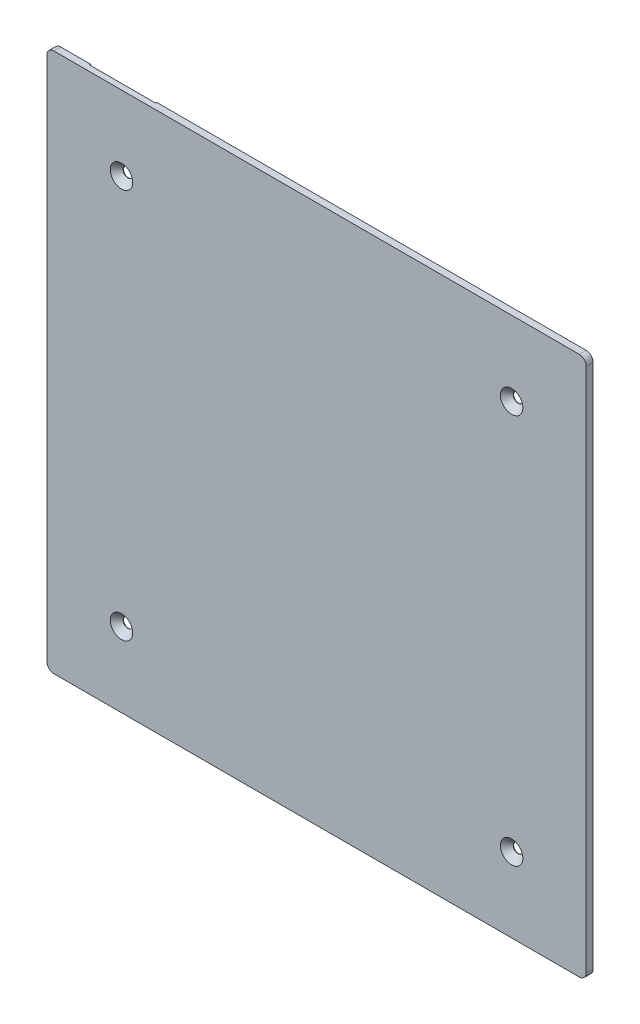
ISO-10303-21;
HEADER;
FILE_DESCRIPTION(('STEP AP214'),'2;1');
FILE_NAME('part.step','',(''),(''),'','','');
FILE_SCHEMA(('AUTOMOTIVE_DESIGN { 1 0 10303 214 1 1 1 1 }'));
ENDSEC;
DATA;
#1=APPLICATION_CONTEXT('core data for automotive mechanical design processes');
#2=APPLICATION_PROTOCOL_DEFINITION('international standard','automotive_design',2000,#1);
#3=PRODUCT_CONTEXT('',#1,'mechanical');
#4=PRODUCT('Part','Part','',(#3));
#5=PRODUCT_RELATED_PRODUCT_CATEGORY('part','',(#4));
#6=PRODUCT_DEFINITION_FORMATION('','',#4);
#7=PRODUCT_DEFINITION_CONTEXT('part definition',#1,'design');
#8=PRODUCT_DEFINITION('design','',#6,#7);
#9=PRODUCT_DEFINITION_SHAPE('','',#8);
#10=(LENGTH_UNIT() NAMED_UNIT(*) SI_UNIT(.MILLI.,.METRE.));
#11=(NAMED_UNIT(*) PLANE_ANGLE_UNIT() SI_UNIT($,.RADIAN.));
#12=(NAMED_UNIT(*) SI_UNIT($,.STERADIAN.) SOLID_ANGLE_UNIT());
#13=UNCERTAINTY_MEASURE_WITH_UNIT(LENGTH_MEASURE(1.E-05),#10,'distance_accuracy_value','');
#14=(GEOMETRIC_REPRESENTATION_CONTEXT(3) GLOBAL_UNCERTAINTY_ASSIGNED_CONTEXT((#13)) GLOBAL_UNIT_ASSIGNED_CONTEXT((#10,
#11,#12)) REPRESENTATION_CONTEXT('',''));
#15=CARTESIAN_POINT('',(0.,0.,0.));
#16=DIRECTION('',(0.,0.,1.));
#17=DIRECTION('',(1.,0.,0.));
#18=AXIS2_PLACEMENT_3D('',#15,#16,#17);
#19=CARTESIAN_POINT('',(-72.6507614869108,117.5,0.5));
#20=DIRECTION('',(1.,0.,0.));
#21=DIRECTION('',(0.,0.,-1.));
#22=AXIS2_PLACEMENT_3D('',#19,#20,#21);
#23=PLANE('',#22);
#24=DIRECTION('',(0.,0.,-1.));
#25=VECTOR('',#24,1.);
#26=CARTESIAN_POINT('',(-72.6507614869108,106.050790199477,0.5));
#27=LINE('',#26,#25);
#28=CARTESIAN_POINT('',(-72.6507614869108,106.050790199477,0.));
#29=VERTEX_POINT('',#28);
#30=CARTESIAN_POINT('',(-72.6507614869108,106.050790199477,0.5));
#31=VERTEX_POINT('',#30);
#32=EDGE_CURVE('E169',#29,#31,#27,.F.);
#33=ORIENTED_EDGE('',*,*,#32,.T.);
#34=DIRECTION('',(0.,1.,0.));
#35=VECTOR('',#34,1.);
#36=CARTESIAN_POINT('',(-72.6507614869108,0.,0.5));
#37=LINE('',#36,#35);
#38=CARTESIAN_POINT('',(-72.6507614869108,117.5,0.5));
#39=VERTEX_POINT('',#38);
#40=EDGE_CURVE('E116',#39,#31,#37,.F.);
#41=ORIENTED_EDGE('',*,*,#40,.F.);
#42=DIRECTION('',(0.,0.,-1.));
#43=VECTOR('',#42,1.);
#44=CARTESIAN_POINT('',(-72.6507614869108,117.5,0.5));
#45=LINE('',#44,#43);
#46=CARTESIAN_POINT('',(-72.6507614869108,117.5,0.));
#47=VERTEX_POINT('',#46);
#48=EDGE_CURVE('E112',#47,#39,#45,.F.);
#49=ORIENTED_EDGE('',*,*,#48,.F.);
#50=DIRECTION('',(0.,1.,0.));
#51=VECTOR('',#50,1.);
#52=CARTESIAN_POINT('',(-72.6507614869108,0.,0.));
#53=LINE('',#52,#51);
#54=EDGE_CURVE('E115',#29,#47,#53,.T.);
#55=ORIENTED_EDGE('',*,*,#54,.F.);
#56=EDGE_LOOP('',(#33,#41,#49,#55));
#57=FACE_BOUND('',#56,.T.);
#58=ADVANCED_FACE('F16',(#57),#23,.F.);
#59=CARTESIAN_POINT('',(-101.46292574176,117.5,0.5));
#60=DIRECTION('',(-1.,0.,0.));
#61=DIRECTION('',(0.,0.,1.));
#62=AXIS2_PLACEMENT_3D('',#59,#60,#61);
#63=PLANE('',#62);
#64=DIRECTION('',(0.,0.,1.));
#65=VECTOR('',#64,1.);
#66=CARTESIAN_POINT('',(-101.46292574176,117.5,0.5));
#67=LINE('',#66,#65);
#68=CARTESIAN_POINT('',(-101.46292574176,117.5,0.5));
#69=VERTEX_POINT('',#68);
#70=CARTESIAN_POINT('',(-101.46292574176,117.5,0.));
#71=VERTEX_POINT('',#70);
#72=EDGE_CURVE('E121',#69,#71,#67,.F.);
#73=ORIENTED_EDGE('',*,*,#72,.F.);
#74=DIRECTION('',(0.,1.,0.));
#75=VECTOR('',#74,1.);
#76=CARTESIAN_POINT('',(-101.46292574176,0.,0.5));
#77=LINE('',#76,#75);
#78=CARTESIAN_POINT('',(-101.46292574176,106.050790199477,0.5));
#79=VERTEX_POINT('',#78);
#80=EDGE_CURVE('E129',#79,#69,#77,.T.);
#81=ORIENTED_EDGE('',*,*,#80,.F.);
#82=DIRECTION('',(0.,0.,-1.));
#83=VECTOR('',#82,1.);
#84=CARTESIAN_POINT('',(-101.46292574176,106.050790199477,0.5));
#85=LINE('',#84,#83);
#86=CARTESIAN_POINT('',(-101.46292574176,106.050790199477,0.));
#87=VERTEX_POINT('',#86);
#88=EDGE_CURVE('E172',#79,#87,#85,.T.);
#89=ORIENTED_EDGE('',*,*,#88,.T.);
#90=DIRECTION('',(0.,1.,0.));
#91=VECTOR('',#90,1.);
#92=CARTESIAN_POINT('',(-101.46292574176,0.,0.));
#93=LINE('',#92,#91);
#94=EDGE_CURVE('E93',#71,#87,#93,.F.);
#95=ORIENTED_EDGE('',*,*,#94,.F.);
#96=EDGE_LOOP('',(#73,#81,#89,#95));
#97=FACE_BOUND('',#96,.T.);
#98=ADVANCED_FACE('F336',(#97),#63,.F.);
#99=CARTESIAN_POINT('',(-72.6507614869108,106.050790199477,0.5));
#100=DIRECTION('',(0.,-1.,0.));
#101=DIRECTION('',(0.,0.,-1.));
#102=AXIS2_PLACEMENT_3D('',#99,#100,#101);
#103=PLANE('',#102);
#104=ORIENTED_EDGE('',*,*,#88,.F.);
#105=DIRECTION('',(-1.,0.,0.));
#106=VECTOR('',#105,1.);
#107=CARTESIAN_POINT('',(0.,106.050790199477,0.5));
#108=LINE('',#107,#106);
#109=EDGE_CURVE('E184',#31,#79,#108,.T.);
#110=ORIENTED_EDGE('',*,*,#109,.F.);
#111=ORIENTED_EDGE('',*,*,#32,.F.);
#112=DIRECTION('',(-1.,0.,0.));
#113=VECTOR('',#112,1.);
#114=CARTESIAN_POINT('',(0.,106.050790199477,0.));
#115=LINE('',#114,#113);
#116=EDGE_CURVE('E128',#87,#29,#115,.F.);
#117=ORIENTED_EDGE('',*,*,#116,.F.);
#118=EDGE_LOOP('',(#104,#110,#111,#117));
#119=FACE_BOUND('',#118,.T.);
#120=ADVANCED_FACE('F249',(#119),#103,.F.);
#121=CARTESIAN_POINT('',(-85.,-85.,3.));
#122=DIRECTION('',(0.,0.,-1.));
#123=DIRECTION('',(-1.,0.,0.));
#124=AXIS2_PLACEMENT_3D('',#121,#122,#123);
#125=CYLINDRICAL_SURFACE('',#124,2.1);
#126=CARTESIAN_POINT('',(-85.,-85.,0.));
#127=DIRECTION('',(0.,0.,-1.));
#128=DIRECTION('',(-1.,0.,0.));
#129=AXIS2_PLACEMENT_3D('',#126,#127,#128);
#130=CIRCLE('',#129,2.1);
#131=CARTESIAN_POINT('',(-87.1,-85.,0.));
#132=VERTEX_POINT('',#131);
#133=EDGE_CURVE('E19',#132,#132,#130,.F.);
#134=ORIENTED_EDGE('',*,*,#133,.F.);
#135=EDGE_LOOP('',(#134));
#136=FACE_BOUND('',#135,.T.);
#137=CARTESIAN_POINT('',(-85.,-85.,0.200000000006639));
#138=DIRECTION('',(0.,0.,1.));
#139=DIRECTION('',(1.,0.,0.));
#140=AXIS2_PLACEMENT_3D('',#137,#138,#139);
#141=CIRCLE('',#140,2.09999999994806);
#142=CARTESIAN_POINT('',(-82.9000000000519,-85.,0.200000000006639));
#143=VERTEX_POINT('',#142);
#144=EDGE_CURVE('E164',#143,#143,#141,.T.);
#145=ORIENTED_EDGE('',*,*,#144,.T.);
#146=EDGE_LOOP('',(#145));
#147=FACE_BOUND('',#146,.T.);
#148=ADVANCED_FACE('F245',(#136,#147),#125,.F.);
#149=CARTESIAN_POINT('',(85.,-85.,3.));
#150=DIRECTION('',(0.,0.,-1.));
#151=DIRECTION('',(-1.,0.,0.));
#152=AXIS2_PLACEMENT_3D('',#149,#150,#151);
#153=CYLINDRICAL_SURFACE('',#152,2.1);
#154=CARTESIAN_POINT('',(85.,-85.,0.));
#155=DIRECTION('',(0.,0.,-1.));
#156=DIRECTION('',(-1.,0.,0.));
#157=AXIS2_PLACEMENT_3D('',#154,#155,#156);
#158=CIRCLE('',#157,2.1);
#159=CARTESIAN_POINT('',(82.9,-85.,0.));
#160=VERTEX_POINT('',#159);
#161=EDGE_CURVE('E167',#160,#160,#158,.F.);
#162=ORIENTED_EDGE('',*,*,#161,.F.);
#163=EDGE_LOOP('',(#162));
#164=FACE_BOUND('',#163,.T.);
#165=CARTESIAN_POINT('',(85.,-85.,0.200000000006639));
#166=DIRECTION('',(0.,0.,1.));
#167=DIRECTION('',(1.,0.,0.));
#168=AXIS2_PLACEMENT_3D('',#165,#166,#167);
#169=CIRCLE('',#168,2.09999999996396);
#170=CARTESIAN_POINT('',(87.099999999964,-85.,0.200000000006639));
#171=VERTEX_POINT('',#170);
#172=EDGE_CURVE('E161',#171,#171,#169,.T.);
#173=ORIENTED_EDGE('',*,*,#172,.T.);
#174=EDGE_LOOP('',(#173));
#175=FACE_BOUND('',#174,.T.);
#176=ADVANCED_FACE('F248',(#164,#175),#153,.F.);
#177=CARTESIAN_POINT('',(85.,85.,3.));
#178=DIRECTION('',(0.,0.,-1.));
#179=DIRECTION('',(-1.,0.,0.));
#180=AXIS2_PLACEMENT_3D('',#177,#178,#179);
#181=CYLINDRICAL_SURFACE('',#180,2.1);
#182=CARTESIAN_POINT('',(85.,85.,0.));
#183=DIRECTION('',(0.,0.,-1.));
#184=DIRECTION('',(-1.,0.,0.));
#185=AXIS2_PLACEMENT_3D('',#182,#183,#184);
#186=CIRCLE('',#185,2.1);
#187=CARTESIAN_POINT('',(82.9,85.,0.));
#188=VERTEX_POINT('',#187);
#189=EDGE_CURVE('E235',#188,#188,#186,.F.);
#190=ORIENTED_EDGE('',*,*,#189,.F.);
#191=EDGE_LOOP('',(#190));
#192=FACE_BOUND('',#191,.T.);
#193=CARTESIAN_POINT('',(85.,85.,0.200000000006639));
#194=DIRECTION('',(0.,0.,1.));
#195=DIRECTION('',(1.,0.,0.));
#196=AXIS2_PLACEMENT_3D('',#193,#194,#195);
#197=CIRCLE('',#196,2.09999999996396);
#198=CARTESIAN_POINT('',(87.099999999964,85.,0.200000000006639));
#199=VERTEX_POINT('',#198);
#200=EDGE_CURVE('E158',#199,#199,#197,.T.);
#201=ORIENTED_EDGE('',*,*,#200,.T.);
#202=EDGE_LOOP('',(#201));
#203=FACE_BOUND('',#202,.T.);
#204=ADVANCED_FACE('F319',(#192,#203),#181,.F.);
#205=CARTESIAN_POINT('',(-85.,85.,3.));
#206=DIRECTION('',(0.,0.,-1.));
#207=DIRECTION('',(-1.,0.,0.));
#208=AXIS2_PLACEMENT_3D('',#205,#206,#207);
#209=CYLINDRICAL_SURFACE('',#208,2.1);
#210=CARTESIAN_POINT('',(-85.,85.,0.));
#211=DIRECTION('',(0.,0.,-1.));
#212=DIRECTION('',(-1.,0.,0.));
#213=AXIS2_PLACEMENT_3D('',#210,#211,#212);
#214=CIRCLE('',#213,2.1);
#215=CARTESIAN_POINT('',(-87.1,85.,0.));
#216=VERTEX_POINT('',#215);
#217=EDGE_CURVE('E237',#216,#216,#214,.F.);
#218=ORIENTED_EDGE('',*,*,#217,.F.);
#219=EDGE_LOOP('',(#218));
#220=FACE_BOUND('',#219,.T.);
#221=CARTESIAN_POINT('',(-85.,85.,0.200000000006639));
#222=DIRECTION('',(0.,0.,1.));
#223=DIRECTION('',(1.,0.,0.));
#224=AXIS2_PLACEMENT_3D('',#221,#222,#223);
#225=CIRCLE('',#224,2.09999999994806);
#226=CARTESIAN_POINT('',(-82.9000000000519,85.,0.200000000006639));
#227=VERTEX_POINT('',#226);
#228=EDGE_CURVE('E155',#227,#227,#225,.T.);
#229=ORIENTED_EDGE('',*,*,#228,.T.);
#230=EDGE_LOOP('',(#229));
#231=FACE_BOUND('',#230,.T.);
#232=ADVANCED_FACE('F321',(#220,#231),#209,.F.);
#233=CARTESIAN_POINT('',(0.,0.,0.5));
#234=DIRECTION('',(0.,0.,-1.));
#235=DIRECTION('',(-1.,0.,0.));
#236=AXIS2_PLACEMENT_3D('',#233,#234,#235);
#237=PLANE('',#236);
#238=ORIENTED_EDGE('',*,*,#80,.T.);
#239=DIRECTION('',(1.,0.,0.));
#240=VECTOR('',#239,1.);
#241=CARTESIAN_POINT('',(-117.5,117.5,0.5));
#242=LINE('',#241,#240);
#243=EDGE_CURVE('E135',#69,#39,#242,.T.);
#244=ORIENTED_EDGE('',*,*,#243,.T.);
#245=ORIENTED_EDGE('',*,*,#40,.T.);
#246=ORIENTED_EDGE('',*,*,#109,.T.);
#247=EDGE_LOOP('',(#238,#244,#245,#246));
#248=FACE_BOUND('',#247,.T.);
#249=ADVANCED_FACE('F266',(#248),#237,.T.);
#250=CARTESIAN_POINT('',(0.,0.,0.));
#251=DIRECTION('',(0.,0.,-1.));
#252=DIRECTION('',(-1.,0.,0.));
#253=AXIS2_PLACEMENT_3D('',#250,#251,#252);
#254=PLANE('',#253);
#255=ORIENTED_EDGE('',*,*,#161,.T.);
#256=EDGE_LOOP('',(#255));
#257=FACE_BOUND('',#256,.T.);
#258=ORIENTED_EDGE('',*,*,#189,.T.);
#259=EDGE_LOOP('',(#258));
#260=FACE_BOUND('',#259,.T.);
#261=ORIENTED_EDGE('',*,*,#217,.T.);
#262=EDGE_LOOP('',(#261));
#263=FACE_BOUND('',#262,.T.);
#264=ORIENTED_EDGE('',*,*,#133,.T.);
#265=EDGE_LOOP('',(#264));
#266=FACE_BOUND('',#265,.T.);
#267=ORIENTED_EDGE('',*,*,#94,.T.);
#268=ORIENTED_EDGE('',*,*,#116,.T.);
#269=ORIENTED_EDGE('',*,*,#54,.T.);
#270=DIRECTION('',(1.,0.,0.));
#271=VECTOR('',#270,1.);
#272=CARTESIAN_POINT('',(-117.5,117.5,0.));
#273=LINE('',#272,#271);
#274=CARTESIAN_POINT('',(114.5,117.5,0.));
#275=VERTEX_POINT('',#274);
#276=EDGE_CURVE('E125',#47,#275,#273,.T.);
#277=ORIENTED_EDGE('',*,*,#276,.T.);
#278=CARTESIAN_POINT('',(114.5,114.5,0.));
#279=DIRECTION('',(0.,0.,-1.));
#280=DIRECTION('',(-1.,0.,0.));
#281=AXIS2_PLACEMENT_3D('',#278,#279,#280);
#282=CIRCLE('',#281,3.);
#283=CARTESIAN_POINT('',(117.5,114.5,0.));
#284=VERTEX_POINT('',#283);
#285=EDGE_CURVE('E134',#284,#275,#282,.F.);
#286=ORIENTED_EDGE('',*,*,#285,.F.);
#287=DIRECTION('',(0.,1.,0.));
#288=VECTOR('',#287,1.);
#289=CARTESIAN_POINT('',(117.5,-117.5,0.));
#290=LINE('',#289,#288);
#291=CARTESIAN_POINT('',(117.5,-114.5,0.));
#292=VERTEX_POINT('',#291);
#293=EDGE_CURVE('E142',#284,#292,#290,.F.);
#294=ORIENTED_EDGE('',*,*,#293,.T.);
#295=CARTESIAN_POINT('',(114.5,-114.5,0.));
#296=DIRECTION('',(0.,0.,-1.));
#297=DIRECTION('',(-1.,0.,0.));
#298=AXIS2_PLACEMENT_3D('',#295,#296,#297);
#299=CIRCLE('',#298,3.);
#300=CARTESIAN_POINT('',(114.5,-117.5,0.));
#301=VERTEX_POINT('',#300);
#302=EDGE_CURVE('E229',#301,#292,#299,.F.);
#303=ORIENTED_EDGE('',*,*,#302,.F.);
#304=DIRECTION('',(1.,0.,0.));
#305=VECTOR('',#304,1.);
#306=CARTESIAN_POINT('',(-117.5,-117.5,0.));
#307=LINE('',#306,#305);
#308=CARTESIAN_POINT('',(-114.5,-117.5,0.));
#309=VERTEX_POINT('',#308);
#310=EDGE_CURVE('E228',#301,#309,#307,.F.);
#311=ORIENTED_EDGE('',*,*,#310,.T.);
#312=CARTESIAN_POINT('',(-114.5,-114.5,0.));
#313=DIRECTION('',(0.,0.,-1.));
#314=DIRECTION('',(-1.,0.,0.));
#315=AXIS2_PLACEMENT_3D('',#312,#313,#314);
#316=CIRCLE('',#315,3.);
#317=CARTESIAN_POINT('',(-117.5,-114.5,0.));
#318=VERTEX_POINT('',#317);
#319=EDGE_CURVE('E225',#318,#309,#316,.F.);
#320=ORIENTED_EDGE('',*,*,#319,.F.);
#321=DIRECTION('',(0.,1.,0.));
#322=VECTOR('',#321,1.);
#323=CARTESIAN_POINT('',(-117.5,-117.5,0.));
#324=LINE('',#323,#322);
#325=CARTESIAN_POINT('',(-117.5,114.5,0.));
#326=VERTEX_POINT('',#325);
#327=EDGE_CURVE('E224',#318,#326,#324,.T.);
#328=ORIENTED_EDGE('',*,*,#327,.T.);
#329=CARTESIAN_POINT('',(-114.5,114.5,0.));
#330=DIRECTION('',(0.,0.,-1.));
#331=DIRECTION('',(-1.,0.,0.));
#332=AXIS2_PLACEMENT_3D('',#329,#330,#331);
#333=CIRCLE('',#332,3.);
#334=CARTESIAN_POINT('',(-114.5,117.5,0.));
#335=VERTEX_POINT('',#334);
#336=EDGE_CURVE('E83',#335,#326,#333,.F.);
#337=ORIENTED_EDGE('',*,*,#336,.F.);
#338=DIRECTION('',(1.,0.,0.));
#339=VECTOR('',#338,1.);
#340=CARTESIAN_POINT('',(-117.5,117.5,0.));
#341=LINE('',#340,#339);
#342=EDGE_CURVE('E138',#335,#71,#341,.T.);
#343=ORIENTED_EDGE('',*,*,#342,.T.);
#344=EDGE_LOOP('',(#267,#268,#269,#277,#286,#294,#303,#311,#320,#328,#337,#343));
#345=FACE_BOUND('',#344,.T.);
#346=ADVANCED_FACE('F124',(#257,#260,#263,#266,#345),#254,.T.);
#347=CARTESIAN_POINT('',(-85.,-85.,2.9999999999859));
#348=DIRECTION('',(0.,0.,1.));
#349=DIRECTION('',(1.,0.,0.));
#350=AXIS2_PLACEMENT_3D('',#347,#348,#349);
#351=CONICAL_SURFACE('',#350,4.89999999998417,0.785398163407599);
#352=CARTESIAN_POINT('',(-85.,-85.,3.00000000002229));
#353=DIRECTION('',(0.,0.,1.));
#354=DIRECTION('',(1.,0.,0.));
#355=AXIS2_PLACEMENT_3D('',#352,#353,#354);
#356=CIRCLE('',#355,4.90000000002055);
#357=CARTESIAN_POINT('',(-80.0999999999794,-85.,3.00000000002229));
#358=VERTEX_POINT('',#357);
#359=EDGE_CURVE('E221',#358,#358,#356,.T.);
#360=ORIENTED_EDGE('',*,*,#359,.T.);
#361=EDGE_LOOP('',(#360));
#362=FACE_BOUND('',#361,.T.);
#363=ORIENTED_EDGE('',*,*,#144,.F.);
#364=EDGE_LOOP('',(#363));
#365=FACE_BOUND('',#364,.T.);
#366=ADVANCED_FACE('F253',(#362,#365),#351,.F.);
#367=CARTESIAN_POINT('',(85.,-85.,2.99999999987222));
#368=DIRECTION('',(0.,0.,1.));
#369=DIRECTION('',(0.,-1.,0.));
#370=AXIS2_PLACEMENT_3D('',#367,#368,#369);
#371=CONICAL_SURFACE('',#370,4.89999999988638,0.785398163397448);
#372=CARTESIAN_POINT('',(85.,-85.,2.9999999999859));
#373=DIRECTION('',(0.,0.,1.));
#374=DIRECTION('',(0.,-1.,0.));
#375=AXIS2_PLACEMENT_3D('',#372,#373,#374);
#376=CIRCLE('',#375,4.90000000000007);
#377=CARTESIAN_POINT('',(85.,-89.9000000000001,2.9999999999859));
#378=VERTEX_POINT('',#377);
#379=EDGE_CURVE('E218',#378,#378,#376,.T.);
#380=ORIENTED_EDGE('',*,*,#379,.T.);
#381=EDGE_LOOP('',(#380));
#382=FACE_BOUND('',#381,.T.);
#383=ORIENTED_EDGE('',*,*,#172,.F.);
#384=EDGE_LOOP('',(#383));
#385=FACE_BOUND('',#384,.T.);
#386=ADVANCED_FACE('F255',(#382,#385),#371,.F.);
#387=CARTESIAN_POINT('',(85.,85.,2.99999999987222));
#388=DIRECTION('',(0.,0.,1.));
#389=DIRECTION('',(0.,-1.,0.));
#390=AXIS2_PLACEMENT_3D('',#387,#388,#389);
#391=CONICAL_SURFACE('',#390,4.89999999988638,0.785398163397448);
#392=CARTESIAN_POINT('',(85.,85.,2.9999999999859));
#393=DIRECTION('',(0.,0.,1.));
#394=DIRECTION('',(0.,-1.,0.));
#395=AXIS2_PLACEMENT_3D('',#392,#393,#394);
#396=CIRCLE('',#395,4.90000000000007);
#397=CARTESIAN_POINT('',(85.,80.1,2.9999999999859));
#398=VERTEX_POINT('',#397);
#399=EDGE_CURVE('E215',#398,#398,#396,.T.);
#400=ORIENTED_EDGE('',*,*,#399,.T.);
#401=EDGE_LOOP('',(#400));
#402=FACE_BOUND('',#401,.T.);
#403=ORIENTED_EDGE('',*,*,#200,.F.);
#404=EDGE_LOOP('',(#403));
#405=FACE_BOUND('',#404,.T.);
#406=ADVANCED_FACE('F263',(#402,#405),#391,.F.);
#407=CARTESIAN_POINT('',(-85.,85.,2.9999999999859));
#408=DIRECTION('',(0.,0.,1.));
#409=DIRECTION('',(1.,0.,0.));
#410=AXIS2_PLACEMENT_3D('',#407,#408,#409);
#411=CONICAL_SURFACE('',#410,4.89999999998417,0.785398163407599);
#412=CARTESIAN_POINT('',(-85.,85.,3.00000000002229));
#413=DIRECTION('',(0.,0.,1.));
#414=DIRECTION('',(1.,0.,0.));
#415=AXIS2_PLACEMENT_3D('',#412,#413,#414);
#416=CIRCLE('',#415,4.90000000002055);
#417=CARTESIAN_POINT('',(-80.0999999999794,85.,3.00000000002229));
#418=VERTEX_POINT('',#417);
#419=EDGE_CURVE('E212',#418,#418,#416,.T.);
#420=ORIENTED_EDGE('',*,*,#419,.T.);
#421=EDGE_LOOP('',(#420));
#422=FACE_BOUND('',#421,.T.);
#423=ORIENTED_EDGE('',*,*,#228,.F.);
#424=EDGE_LOOP('',(#423));
#425=FACE_BOUND('',#424,.T.);
#426=ADVANCED_FACE('F306',(#422,#425),#411,.F.);
#427=CARTESIAN_POINT('',(-114.5,114.5,3.));
#428=DIRECTION('',(0.,0.,-1.));
#429=DIRECTION('',(-1.,0.,0.));
#430=AXIS2_PLACEMENT_3D('',#427,#428,#429);
#431=CYLINDRICAL_SURFACE('',#430,3.);
#432=ORIENTED_EDGE('',*,*,#336,.T.);
#433=DIRECTION('',(0.,0.,-1.));
#434=VECTOR('',#433,1.);
#435=CARTESIAN_POINT('',(-117.5,114.5,3.));
#436=LINE('',#435,#434);
#437=CARTESIAN_POINT('',(-117.5,114.5,3.));
#438=VERTEX_POINT('',#437);
#439=EDGE_CURVE('E544',#326,#438,#436,.F.);
#440=ORIENTED_EDGE('',*,*,#439,.T.);
#441=CARTESIAN_POINT('',(-114.5,114.5,3.));
#442=DIRECTION('',(0.,0.,-1.));
#443=DIRECTION('',(-1.,0.,0.));
#444=AXIS2_PLACEMENT_3D('',#441,#442,#443);
#445=CIRCLE('',#444,3.);
#446=CARTESIAN_POINT('',(-114.5,117.5,3.));
#447=VERTEX_POINT('',#446);
#448=EDGE_CURVE('E209',#438,#447,#445,.T.);
#449=ORIENTED_EDGE('',*,*,#448,.T.);
#450=DIRECTION('',(0.,0.,-1.));
#451=VECTOR('',#450,1.);
#452=CARTESIAN_POINT('',(-114.5,117.5,3.));
#453=LINE('',#452,#451);
#454=EDGE_CURVE('E149',#447,#335,#453,.T.);
#455=ORIENTED_EDGE('',*,*,#454,.T.);
#456=EDGE_LOOP('',(#432,#440,#449,#455));
#457=FACE_BOUND('',#456,.T.);
#458=ADVANCED_FACE('F303',(#457),#431,.T.);
#459=CARTESIAN_POINT('',(-117.5,117.5,3.));
#460=DIRECTION('',(0.,-1.,0.));
#461=DIRECTION('',(0.,0.,-1.));
#462=AXIS2_PLACEMENT_3D('',#459,#460,#461);
#463=PLANE('',#462);
#464=ORIENTED_EDGE('',*,*,#48,.T.);
#465=ORIENTED_EDGE('',*,*,#243,.F.);
#466=ORIENTED_EDGE('',*,*,#72,.T.);
#467=ORIENTED_EDGE('',*,*,#342,.F.);
#468=ORIENTED_EDGE('',*,*,#454,.F.);
#469=DIRECTION('',(-1.,0.,0.));
#470=VECTOR('',#469,1.);
#471=CARTESIAN_POINT('',(0.,117.5,3.));
#472=LINE('',#471,#470);
#473=CARTESIAN_POINT('',(114.5,117.5,3.));
#474=VERTEX_POINT('',#473);
#475=EDGE_CURVE('E208',#447,#474,#472,.F.);
#476=ORIENTED_EDGE('',*,*,#475,.T.);
#477=DIRECTION('',(0.,0.,-1.));
#478=VECTOR('',#477,1.);
#479=CARTESIAN_POINT('',(114.5,117.5,3.));
#480=LINE('',#479,#478);
#481=EDGE_CURVE('E133',#275,#474,#480,.F.);
#482=ORIENTED_EDGE('',*,*,#481,.F.);
#483=ORIENTED_EDGE('',*,*,#276,.F.);
#484=EDGE_LOOP('',(#464,#465,#466,#467,#468,#476,#482,#483));
#485=FACE_BOUND('',#484,.T.);
#486=ADVANCED_FACE('F131',(#485),#463,.F.);
#487=CARTESIAN_POINT('',(114.5,114.5,3.));
#488=DIRECTION('',(0.,0.,-1.));
#489=DIRECTION('',(-1.,0.,0.));
#490=AXIS2_PLACEMENT_3D('',#487,#488,#489);
#491=CYLINDRICAL_SURFACE('',#490,3.);
#492=ORIENTED_EDGE('',*,*,#285,.T.);
#493=ORIENTED_EDGE('',*,*,#481,.T.);
#494=CARTESIAN_POINT('',(114.5,114.5,3.));
#495=DIRECTION('',(0.,0.,-1.));
#496=DIRECTION('',(-1.,0.,0.));
#497=AXIS2_PLACEMENT_3D('',#494,#495,#496);
#498=CIRCLE('',#497,3.);
#499=CARTESIAN_POINT('',(117.5,114.5,3.));
#500=VERTEX_POINT('',#499);
#501=EDGE_CURVE('E205',#474,#500,#498,.T.);
#502=ORIENTED_EDGE('',*,*,#501,.T.);
#503=DIRECTION('',(0.,0.,1.));
#504=VECTOR('',#503,1.);
#505=CARTESIAN_POINT('',(117.5,114.5,3.));
#506=LINE('',#505,#504);
#507=EDGE_CURVE('E533',#500,#284,#506,.F.);
#508=ORIENTED_EDGE('',*,*,#507,.T.);
#509=EDGE_LOOP('',(#492,#493,#502,#508));
#510=FACE_BOUND('',#509,.T.);
#511=ADVANCED_FACE('F296',(#510),#491,.T.);
#512=CARTESIAN_POINT('',(117.5,-117.5,3.));
#513=DIRECTION('',(-1.,0.,0.));
#514=DIRECTION('',(0.,0.,1.));
#515=AXIS2_PLACEMENT_3D('',#512,#513,#514);
#516=PLANE('',#515);
#517=DIRECTION('',(0.,0.,-1.));
#518=VECTOR('',#517,1.);
#519=CARTESIAN_POINT('',(117.5,-114.5,3.));
#520=LINE('',#519,#518);
#521=CARTESIAN_POINT('',(117.5,-114.5,3.));
#522=VERTEX_POINT('',#521);
#523=EDGE_CURVE('E230',#292,#522,#520,.F.);
#524=ORIENTED_EDGE('',*,*,#523,.F.);
#525=ORIENTED_EDGE('',*,*,#293,.F.);
#526=ORIENTED_EDGE('',*,*,#507,.F.);
#527=DIRECTION('',(0.,1.,0.));
#528=VECTOR('',#527,1.);
#529=CARTESIAN_POINT('',(117.5,0.,3.));
#530=LINE('',#529,#528);
#531=EDGE_CURVE('E204',#500,#522,#530,.F.);
#532=ORIENTED_EDGE('',*,*,#531,.T.);
#533=EDGE_LOOP('',(#524,#525,#526,#532));
#534=FACE_BOUND('',#533,.T.);
#535=ADVANCED_FACE('F292',(#534),#516,.F.);
#536=CARTESIAN_POINT('',(114.5,-114.5,3.));
#537=DIRECTION('',(0.,0.,-1.));
#538=DIRECTION('',(-1.,0.,0.));
#539=AXIS2_PLACEMENT_3D('',#536,#537,#538);
#540=CYLINDRICAL_SURFACE('',#539,3.);
#541=ORIENTED_EDGE('',*,*,#302,.T.);
#542=ORIENTED_EDGE('',*,*,#523,.T.);
#543=CARTESIAN_POINT('',(114.5,-114.5,3.));
#544=DIRECTION('',(0.,0.,-1.));
#545=DIRECTION('',(-1.,0.,0.));
#546=AXIS2_PLACEMENT_3D('',#543,#544,#545);
#547=CIRCLE('',#546,3.);
#548=CARTESIAN_POINT('',(114.5,-117.5,3.));
#549=VERTEX_POINT('',#548);
#550=EDGE_CURVE('E201',#522,#549,#547,.T.);
#551=ORIENTED_EDGE('',*,*,#550,.T.);
#552=DIRECTION('',(0.,0.,1.));
#553=VECTOR('',#552,1.);
#554=CARTESIAN_POINT('',(114.5,-117.5,3.));
#555=LINE('',#554,#553);
#556=EDGE_CURVE('E525',#549,#301,#555,.F.);
#557=ORIENTED_EDGE('',*,*,#556,.T.);
#558=EDGE_LOOP('',(#541,#542,#551,#557));
#559=FACE_BOUND('',#558,.T.);
#560=ADVANCED_FACE('F288',(#559),#540,.T.);
#561=CARTESIAN_POINT('',(-117.5,-117.5,3.));
#562=DIRECTION('',(0.,1.,0.));
#563=DIRECTION('',(0.,0.,1.));
#564=AXIS2_PLACEMENT_3D('',#561,#562,#563);
#565=PLANE('',#564);
#566=DIRECTION('',(0.,0.,-1.));
#567=VECTOR('',#566,1.);
#568=CARTESIAN_POINT('',(-114.5,-117.5,3.));
#569=LINE('',#568,#567);
#570=CARTESIAN_POINT('',(-114.5,-117.5,3.));
#571=VERTEX_POINT('',#570);
#572=EDGE_CURVE('E227',#309,#571,#569,.F.);
#573=ORIENTED_EDGE('',*,*,#572,.F.);
#574=ORIENTED_EDGE('',*,*,#310,.F.);
#575=ORIENTED_EDGE('',*,*,#556,.F.);
#576=DIRECTION('',(-1.,0.,0.));
#577=VECTOR('',#576,1.);
#578=CARTESIAN_POINT('',(0.,-117.5,3.));
#579=LINE('',#578,#577);
#580=EDGE_CURVE('E200',#549,#571,#579,.T.);
#581=ORIENTED_EDGE('',*,*,#580,.T.);
#582=EDGE_LOOP('',(#573,#574,#575,#581));
#583=FACE_BOUND('',#582,.T.);
#584=ADVANCED_FACE('F284',(#583),#565,.F.);
#585=CARTESIAN_POINT('',(-114.5,-114.5,3.));
#586=DIRECTION('',(0.,0.,-1.));
#587=DIRECTION('',(-1.,0.,0.));
#588=AXIS2_PLACEMENT_3D('',#585,#586,#587);
#589=CYLINDRICAL_SURFACE('',#588,3.);
#590=ORIENTED_EDGE('',*,*,#319,.T.);
#591=ORIENTED_EDGE('',*,*,#572,.T.);
#592=CARTESIAN_POINT('',(-114.5,-114.5,3.));
#593=DIRECTION('',(0.,0.,-1.));
#594=DIRECTION('',(-1.,0.,0.));
#595=AXIS2_PLACEMENT_3D('',#592,#593,#594);
#596=CIRCLE('',#595,3.);
#597=CARTESIAN_POINT('',(-117.5,-114.5,3.));
#598=VERTEX_POINT('',#597);
#599=EDGE_CURVE('E25',#571,#598,#596,.T.);
#600=ORIENTED_EDGE('',*,*,#599,.T.);
#601=DIRECTION('',(0.,0.,-1.));
#602=VECTOR('',#601,1.);
#603=CARTESIAN_POINT('',(-117.5,-114.5,3.));
#604=LINE('',#603,#602);
#605=EDGE_CURVE('E33',#598,#318,#604,.T.);
#606=ORIENTED_EDGE('',*,*,#605,.T.);
#607=EDGE_LOOP('',(#590,#591,#600,#606));
#608=FACE_BOUND('',#607,.T.);
#609=ADVANCED_FACE('F277',(#608),#589,.T.);
#610=CARTESIAN_POINT('',(-117.5,-117.5,3.));
#611=DIRECTION('',(1.,0.,0.));
#612=DIRECTION('',(0.,0.,-1.));
#613=AXIS2_PLACEMENT_3D('',#610,#611,#612);
#614=PLANE('',#613);
#615=ORIENTED_EDGE('',*,*,#605,.F.);
#616=DIRECTION('',(0.,1.,0.));
#617=VECTOR('',#616,1.);
#618=CARTESIAN_POINT('',(-117.5,0.,3.));
#619=LINE('',#618,#617);
#620=EDGE_CURVE('E11',#598,#438,#619,.T.);
#621=ORIENTED_EDGE('',*,*,#620,.T.);
#622=ORIENTED_EDGE('',*,*,#439,.F.);
#623=ORIENTED_EDGE('',*,*,#327,.F.);
#624=EDGE_LOOP('',(#615,#621,#622,#623));
#625=FACE_BOUND('',#624,.T.);
#626=ADVANCED_FACE('F271',(#625),#614,.F.);
#627=CARTESIAN_POINT('',(0.,0.,3.));
#628=DIRECTION('',(0.,0.,-1.));
#629=DIRECTION('',(-1.,0.,0.));
#630=AXIS2_PLACEMENT_3D('',#627,#628,#629);
#631=PLANE('',#630);
#632=ORIENTED_EDGE('',*,*,#599,.F.);
#633=ORIENTED_EDGE('',*,*,#580,.F.);
#634=ORIENTED_EDGE('',*,*,#550,.F.);
#635=ORIENTED_EDGE('',*,*,#531,.F.);
#636=ORIENTED_EDGE('',*,*,#501,.F.);
#637=ORIENTED_EDGE('',*,*,#475,.F.);
#638=ORIENTED_EDGE('',*,*,#448,.F.);
#639=ORIENTED_EDGE('',*,*,#620,.F.);
#640=EDGE_LOOP('',(#632,#633,#634,#635,#636,#637,#638,#639));
#641=FACE_BOUND('',#640,.T.);
#642=ORIENTED_EDGE('',*,*,#419,.F.);
#643=EDGE_LOOP('',(#642));
#644=FACE_BOUND('',#643,.T.);
#645=ORIENTED_EDGE('',*,*,#399,.F.);
#646=EDGE_LOOP('',(#645));
#647=FACE_BOUND('',#646,.T.);
#648=ORIENTED_EDGE('',*,*,#379,.F.);
#649=EDGE_LOOP('',(#648));
#650=FACE_BOUND('',#649,.T.);
#651=ORIENTED_EDGE('',*,*,#359,.F.);
#652=EDGE_LOOP('',(#651));
#653=FACE_BOUND('',#652,.T.);
#654=ADVANCED_FACE('F269',(#641,#644,#647,#650,#653),#631,.F.);
#655=CLOSED_SHELL('',(#58,#98,#120,#148,#176,#204,#232,#249,#346,#366,#386,#406,#426,#458,#486,
#511,#535,#560,#584,#609,#626,#654));
#656=MANIFOLD_SOLID_BREP('B1',#655);
#657=ADVANCED_BREP_SHAPE_REPRESENTATION('',(#18,#656),#14);
#658=SHAPE_DEFINITION_REPRESENTATION(#9,#657);
ENDSEC;
END-ISO-10303-21;
